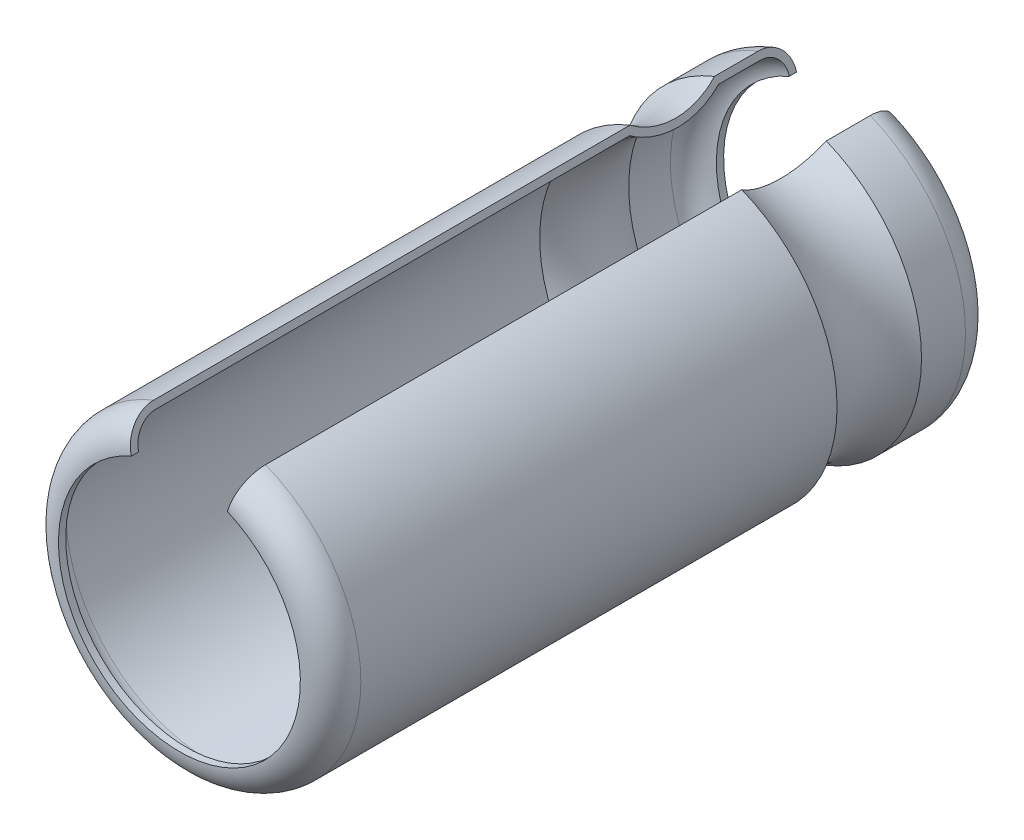
ISO-10303-21;
HEADER;
FILE_DESCRIPTION(('STEP AP214'),'2;1');
FILE_NAME('part.step','',(''),(''),'','','');
FILE_SCHEMA(('AUTOMOTIVE_DESIGN { 1 0 10303 214 1 1 1 1 }'));
ENDSEC;
DATA;
#1=APPLICATION_CONTEXT('core data for automotive mechanical design processes');
#2=APPLICATION_PROTOCOL_DEFINITION('international standard','automotive_design',2000,#1);
#3=PRODUCT_CONTEXT('',#1,'mechanical');
#4=PRODUCT('Part','Part','',(#3));
#5=PRODUCT_RELATED_PRODUCT_CATEGORY('part','',(#4));
#6=PRODUCT_DEFINITION_FORMATION('','',#4);
#7=PRODUCT_DEFINITION_CONTEXT('part definition',#1,'design');
#8=PRODUCT_DEFINITION('design','',#6,#7);
#9=PRODUCT_DEFINITION_SHAPE('','',#8);
#10=(LENGTH_UNIT() NAMED_UNIT(*) SI_UNIT(.MILLI.,.METRE.));
#11=(NAMED_UNIT(*) PLANE_ANGLE_UNIT() SI_UNIT($,.RADIAN.));
#12=(NAMED_UNIT(*) SI_UNIT($,.STERADIAN.) SOLID_ANGLE_UNIT());
#13=UNCERTAINTY_MEASURE_WITH_UNIT(LENGTH_MEASURE(1.E-05),#10,'distance_accuracy_value','');
#14=(GEOMETRIC_REPRESENTATION_CONTEXT(3) GLOBAL_UNCERTAINTY_ASSIGNED_CONTEXT((#13)) GLOBAL_UNIT_ASSIGNED_CONTEXT((#10,
#11,#12)) REPRESENTATION_CONTEXT('',''));
#15=CARTESIAN_POINT('',(0.,0.,0.));
#16=DIRECTION('',(0.,0.,1.));
#17=DIRECTION('',(1.,0.,0.));
#18=AXIS2_PLACEMENT_3D('',#15,#16,#17);
#19=CARTESIAN_POINT('',(-110.435261655171,-75.8999546142996,0.500000000000014));
#20=DIRECTION('',(0.,0.,-1.));
#21=DIRECTION('',(-1.,0.,0.));
#22=AXIS2_PLACEMENT_3D('',#19,#20,#21);
#23=TOROIDAL_SURFACE('',#22,2.00000000000004,0.380000000000008);
#24=CARTESIAN_POINT('',(-109.641007887324,-74.0644271826712,0.120000000000006));
#25=CARTESIAN_POINT('',(-109.635383906919,-74.0434382020589,0.119982183089945));
#26=CARTESIAN_POINT('',(-109.629760715521,-74.0224521660623,0.121823051311531));
#27=CARTESIAN_POINT('',(-109.618674853506,-73.9810791657739,0.12910120959926));
#28=CARTESIAN_POINT('',(-109.613212114462,-73.9606919461139,0.134536942657931));
#29=CARTESIAN_POINT('',(-109.60259748151,-73.9210775966342,0.14888877790404));
#30=CARTESIAN_POINT('',(-109.597445793778,-73.9018512362735,0.157807159898632));
#31=CARTESIAN_POINT('',(-109.587607669952,-73.8651348583048,0.178875538651264));
#32=CARTESIAN_POINT('',(-109.582921098948,-73.8476443372046,0.191024594546105));
#33=CARTESIAN_POINT('',(-109.57417577746,-73.8150063530818,0.218137979558773));
#34=CARTESIAN_POINT('',(-109.570113428074,-73.799845458777,0.233084976072417));
#35=CARTESIAN_POINT('',(-109.562701892984,-73.7721852332574,0.265426320594524));
#36=CARTESIAN_POINT('',(-109.55935284032,-73.7596863985578,0.282821124153812));
#37=CARTESIAN_POINT('',(-109.553494013475,-73.7378209590999,0.31940024723104));
#38=CARTESIAN_POINT('',(-109.550977386384,-73.7284287789311,0.338568202938987));
#39=CARTESIAN_POINT('',(-109.546820528276,-73.7129151732744,0.378267333702773));
#40=CARTESIAN_POINT('',(-109.545179682903,-73.7067914549753,0.398797541747954));
#41=CARTESIAN_POINT('',(-109.543256916143,-73.699615591733,0.43289149503634));
#42=CARTESIAN_POINT('',(-109.542696976279,-73.6975258677123,0.446230745932067));
#43=CARTESIAN_POINT('',(-109.541950048448,-73.6947382950981,0.473044696293518));
#44=CARTESIAN_POINT('',(-109.54176252331,-73.6940384417567,0.48651917245313));
#45=CARTESIAN_POINT('',(-109.541762899096,-73.6940398442099,0.499999999999719));
#46=B_SPLINE_CURVE_WITH_KNOTS('',3,(#24,#25,#26,#27,#28,#29,#30,#31,#32,#33,#34,#35,#36,#37,#38,
#39,#40,#41,#42,#43,#44,#45),.UNSPECIFIED.,.F.,.F.,(4,2,2,2,2,2,2,2,2,2,4),(0.,
0.0651062071288751,0.130184233915878,0.195304933604858,0.260406689043204,0.32511775482558,
0.389840879672177,0.454017082691879,0.518148207027383,0.558617254489897,0.599027886927853),.UNSPECIFIED.);
#47=CARTESIAN_POINT('',(-109.641007887324,-74.0644271826712,0.120000000000011));
#48=VERTEX_POINT('',#47);
#49=CARTESIAN_POINT('',(-109.541762899096,-73.6940398442106,0.499999999999867));
#50=VERTEX_POINT('',#49);
#51=EDGE_CURVE('E120',#48,#50,#46,.T.);
#52=ORIENTED_EDGE('',*,*,#51,.F.);
#53=CARTESIAN_POINT('',(-110.435261655171,-75.8999546142995,0.120000000000016));
#54=DIRECTION('',(0.,0.,1.));
#55=DIRECTION('',(1.,0.,0.));
#56=AXIS2_PLACEMENT_3D('',#53,#54,#55);
#57=CIRCLE('',#56,2.);
#58=CARTESIAN_POINT('',(-111.22951542302,-74.064427182672,0.120000000000013));
#59=VERTEX_POINT('',#58);
#60=EDGE_CURVE('E117',#48,#59,#57,.F.);
#61=ORIENTED_EDGE('',*,*,#60,.T.);
#62=CARTESIAN_POINT('',(-111.328760411247,-73.6940398442121,0.500000000000014));
#63=CARTESIAN_POINT('',(-111.328765258546,-73.6940217538469,0.478744711304542));
#64=CARTESIAN_POINT('',(-111.328295621978,-73.695774461382,0.457495662364422));
#65=CARTESIAN_POINT('',(-111.326443395238,-73.7026870656806,0.415620559484072));
#66=CARTESIAN_POINT('',(-111.325061698906,-73.7078436265919,0.394993916247575));
#67=CARTESIAN_POINT('',(-111.321420479222,-73.7214328434561,0.354921882304476));
#68=CARTESIAN_POINT('',(-111.319160590148,-73.7298668642973,0.335476987639925));
#69=CARTESIAN_POINT('',(-111.31383102529,-73.7497570711323,0.298325542391678));
#70=CARTESIAN_POINT('',(-111.31076144932,-73.7612128846083,0.280618777905263));
#71=CARTESIAN_POINT('',(-111.303890698521,-73.7868548756756,0.247382671889473));
#72=CARTESIAN_POINT('',(-111.300087374578,-73.801049073871,0.23185996419076));
#73=CARTESIAN_POINT('',(-111.291863805386,-73.831739851913,0.203477739930694));
#74=CARTESIAN_POINT('',(-111.287443438973,-73.8482368839536,0.190618747662325));
#75=CARTESIAN_POINT('',(-111.278077565105,-73.8831908010894,0.167828663163788));
#76=CARTESIAN_POINT('',(-111.27312839564,-73.9016613529884,0.157920063876288));
#77=CARTESIAN_POINT('',(-111.262873035486,-73.9399348781306,0.141426123151768));
#78=CARTESIAN_POINT('',(-111.257566998824,-73.95973727654,0.134839358289183));
#79=CARTESIAN_POINT('',(-111.248447507578,-73.9937716812095,0.126673396811358));
#80=CARTESIAN_POINT('',(-111.244687554064,-74.0078040187596,0.124171720097282));
#81=CARTESIAN_POINT('',(-111.237123997928,-74.0360315945451,0.120835164666015));
#82=CARTESIAN_POINT('',(-111.233320467161,-74.0502265646159,0.119997854352116));
#83=CARTESIAN_POINT('',(-111.22951542302,-74.064427182672,0.120000000000006));
#84=B_SPLINE_CURVE_WITH_KNOTS('',3,(#62,#63,#64,#65,#66,#67,#68,#69,#70,#71,#72,#73,#74,#75,#76,
#77,#78,#79,#80,#81,#82,#83),.UNSPECIFIED.,.F.,.F.,(4,2,2,2,2,2,2,2,2,2,4),(0.,
0.0636794548214654,0.127296594825147,0.190940256434635,0.254576075901636,0.318401191900391,
0.382238858538304,0.446551427783718,0.510836415249954,0.554970290773507,0.599039640304285),.UNSPECIFIED.);
#85=CARTESIAN_POINT('',(-111.328760411247,-73.6940398442121,0.500000000000014));
#86=VERTEX_POINT('',#85);
#87=EDGE_CURVE('E30',#86,#59,#84,.T.);
#88=ORIENTED_EDGE('',*,*,#87,.F.);
#89=CARTESIAN_POINT('',(-110.435261655171,-75.8999546142995,0.500000000000014));
#90=DIRECTION('',(0.,0.,1.));
#91=DIRECTION('',(1.,0.,0.));
#92=AXIS2_PLACEMENT_3D('',#89,#90,#91);
#93=CIRCLE('',#92,2.37999999999999);
#94=EDGE_CURVE('E136',#86,#50,#93,.T.);
#95=ORIENTED_EDGE('',*,*,#94,.T.);
#96=EDGE_LOOP('',(#52,#61,#88,#95));
#97=FACE_BOUND('',#96,.T.);
#98=ADVANCED_FACE('F25',(#97),#23,.F.);
#99=CARTESIAN_POINT('',(-110.435261655171,-75.8999546142995,0.86378142466053));
#100=DIRECTION('',(0.,0.,1.));
#101=DIRECTION('',(1.,0.,0.));
#102=AXIS2_PLACEMENT_3D('',#99,#100,#101);
#103=CYLINDRICAL_SURFACE('',#102,2.37999999999999);
#104=ORIENTED_EDGE('',*,*,#94,.F.);
#105=DIRECTION('',(0.,0.,1.));
#106=VECTOR('',#105,1.);
#107=CARTESIAN_POINT('',(-111.328760411247,-73.694039844212,0.86378142466053));
#108=LINE('',#107,#106);
#109=CARTESIAN_POINT('',(-111.328760411247,-73.694039844212,1.18968887625391));
#110=VERTEX_POINT('',#109);
#111=EDGE_CURVE('E111',#110,#86,#108,.F.);
#112=ORIENTED_EDGE('',*,*,#111,.F.);
#113=CARTESIAN_POINT('',(-110.435261655171,-75.8999546142995,1.1896888762539));
#114=DIRECTION('',(0.,0.,-1.));
#115=DIRECTION('',(-1.,0.,0.));
#116=AXIS2_PLACEMENT_3D('',#113,#114,#115);
#117=CIRCLE('',#116,2.38000000000001);
#118=CARTESIAN_POINT('',(-109.541762899097,-73.6940398442112,1.18968887625391));
#119=VERTEX_POINT('',#118);
#120=EDGE_CURVE('E219',#119,#110,#117,.T.);
#121=ORIENTED_EDGE('',*,*,#120,.F.);
#122=DIRECTION('',(0.,0.,1.));
#123=VECTOR('',#122,1.);
#124=CARTESIAN_POINT('',(-109.541762899096,-73.6940398442113,0.86378142466053));
#125=LINE('',#124,#123);
#126=EDGE_CURVE('E143',#50,#119,#125,.T.);
#127=ORIENTED_EDGE('',*,*,#126,.F.);
#128=EDGE_LOOP('',(#104,#112,#121,#127));
#129=FACE_BOUND('',#128,.T.);
#130=ADVANCED_FACE('F304',(#129),#103,.F.);
#131=CARTESIAN_POINT('',(-110.435261655171,-75.8999546142995,0.));
#132=DIRECTION('',(0.,0.,1.));
#133=DIRECTION('',(1.,0.,0.));
#134=AXIS2_PLACEMENT_3D('',#131,#132,#133);
#135=CYLINDRICAL_SURFACE('',#134,2.);
#136=CARTESIAN_POINT('',(-110.435261655171,-75.8999546142995,0.));
#137=DIRECTION('',(0.,0.,1.));
#138=DIRECTION('',(1.,0.,0.));
#139=AXIS2_PLACEMENT_3D('',#136,#137,#138);
#140=CIRCLE('',#139,1.99999999999988);
#141=CARTESIAN_POINT('',(-111.22951542302,-74.064427182672,0.));
#142=VERTEX_POINT('',#141);
#143=CARTESIAN_POINT('',(-109.641007887324,-74.0644271826712,0.));
#144=VERTEX_POINT('',#143);
#145=EDGE_CURVE('E135',#142,#144,#140,.T.);
#146=ORIENTED_EDGE('',*,*,#145,.F.);
#147=DIRECTION('',(0.,0.,1.));
#148=VECTOR('',#147,1.);
#149=CARTESIAN_POINT('',(-111.22951542302,-74.0644271826719,0.));
#150=LINE('',#149,#148);
#151=EDGE_CURVE('E131',#59,#142,#150,.F.);
#152=ORIENTED_EDGE('',*,*,#151,.F.);
#153=ORIENTED_EDGE('',*,*,#60,.F.);
#154=DIRECTION('',(0.,0.,1.));
#155=VECTOR('',#154,1.);
#156=CARTESIAN_POINT('',(-109.641007887323,-74.0644271826712,0.));
#157=LINE('',#156,#155);
#158=EDGE_CURVE('E125',#144,#48,#157,.T.);
#159=ORIENTED_EDGE('',*,*,#158,.F.);
#160=EDGE_LOOP('',(#146,#152,#153,#159));
#161=FACE_BOUND('',#160,.T.);
#162=ADVANCED_FACE('F133',(#161),#135,.F.);
#163=CARTESIAN_POINT('',(-110.435261655171,-75.8999546142995,1.92584497229592));
#164=DIRECTION('',(0.,0.,-1.));
#165=DIRECTION('',(-1.,0.,0.));
#166=AXIS2_PLACEMENT_3D('',#163,#164,#165);
#167=TOROIDAL_SURFACE('',#166,3.46382852414183,1.3101946677816);
#168=CARTESIAN_POINT('',(-111.328760411247,-73.6940398442121,1.18968887625389));
#169=CARTESIAN_POINT('',(-111.323396560608,-73.714058007324,1.21997083257175));
#170=CARTESIAN_POINT('',(-111.318363919213,-73.7328400807056,1.25110792210303));
#171=CARTESIAN_POINT('',(-111.308992004249,-73.7678165435154,1.31490234502008));
#172=CARTESIAN_POINT('',(-111.304652727418,-73.7840109451165,1.34755967125348));
#173=CARTESIAN_POINT('',(-111.292732329592,-73.8284984754499,1.44743497021773));
#174=CARTESIAN_POINT('',(-111.286233591997,-73.8527520943403,1.51664133044735));
#175=CARTESIAN_POINT('',(-111.276342157542,-73.8896674302832,1.65830137878725));
#176=CARTESIAN_POINT('',(-111.272951346183,-73.9023221105569,1.73075701022864));
#177=CARTESIAN_POINT('',(-111.269382278693,-73.9156420517624,1.87683879603604));
#178=CARTESIAN_POINT('',(-111.269203414399,-73.9163095823983,1.95046472616963));
#179=CARTESIAN_POINT('',(-111.272056625018,-73.9056612554009,2.09646857368301));
#180=CARTESIAN_POINT('',(-111.275075665037,-73.8943940446614,2.16885034466408));
#181=CARTESIAN_POINT('',(-111.284213777839,-73.8602901433998,2.31062461659469));
#182=CARTESIAN_POINT('',(-111.290331291315,-73.8374592722906,2.38001860210696));
#183=CARTESIAN_POINT('',(-111.302157128094,-73.7933246485888,2.48456492158868));
#184=CARTESIAN_POINT('',(-111.306876878447,-73.7757103004732,2.52143339000838));
#185=CARTESIAN_POINT('',(-111.317180999474,-73.7372547972738,2.59322339647109));
#186=CARTESIAN_POINT('',(-111.322763612199,-73.7164202029428,2.62814870091386));
#187=CARTESIAN_POINT('',(-111.328760411248,-73.6940398442121,2.66200106833794));
#188=B_SPLINE_CURVE_WITH_KNOTS('',3,(#168,#169,#170,#171,#172,#173,#174,#175,#176,#177,#178,
#179,#180,#181,#182,#183,#184,#185,#186,#187),.UNSPECIFIED.,.F.,.F.,(4,2,2,2,2,2,2,2,2,4),(0.,
0.110017338386147,0.220034159216963,0.439762589306003,0.659624234937885,0.87944425047677,
1.09837169873832,1.31718908105632,1.44042167105631,1.5634064250173),.UNSPECIFIED.);
#189=CARTESIAN_POINT('',(-111.328760411248,-73.6940398442121,2.66200106833794));
#190=VERTEX_POINT('',#189);
#191=EDGE_CURVE('E211',#110,#190,#188,.T.);
#192=ORIENTED_EDGE('',*,*,#191,.T.);
#193=CARTESIAN_POINT('',(-110.435261655171,-75.8999546142995,2.66200106833791));
#194=DIRECTION('',(0.,0.,1.));
#195=DIRECTION('',(1.,0.,0.));
#196=AXIS2_PLACEMENT_3D('',#193,#194,#195);
#197=CIRCLE('',#196,2.38000000000001);
#198=CARTESIAN_POINT('',(-109.541762899097,-73.6940398442112,2.66200106833791));
#199=VERTEX_POINT('',#198);
#200=EDGE_CURVE('E281',#190,#199,#197,.T.);
#201=ORIENTED_EDGE('',*,*,#200,.T.);
#202=CARTESIAN_POINT('',(-109.541762899097,-73.6940398442112,2.66200106833791));
#203=CARTESIAN_POINT('',(-109.547126749737,-73.7140580073231,2.63171911202004));
#204=CARTESIAN_POINT('',(-109.552159391131,-73.7328400807047,2.60058202248876));
#205=CARTESIAN_POINT('',(-109.561531306095,-73.7678165435145,2.5367875995717));
#206=CARTESIAN_POINT('',(-109.565870582926,-73.7840109451156,2.5041302733383));
#207=CARTESIAN_POINT('',(-109.577790980752,-73.828498475449,2.40425497437403));
#208=CARTESIAN_POINT('',(-109.584289718348,-73.8527520943394,2.3350486141444));
#209=CARTESIAN_POINT('',(-109.594181152802,-73.8896674302822,2.19338856580449));
#210=CARTESIAN_POINT('',(-109.597571964162,-73.902322110556,2.1209329343631));
#211=CARTESIAN_POINT('',(-109.601141031651,-73.9156420517615,1.97485114855568));
#212=CARTESIAN_POINT('',(-109.601319895946,-73.9163095823974,1.90122521842209));
#213=CARTESIAN_POINT('',(-109.598466685326,-73.9056612553999,1.7552213709087));
#214=CARTESIAN_POINT('',(-109.595447645307,-73.8943940446604,1.68283959992762));
#215=CARTESIAN_POINT('',(-109.586309532506,-73.8602901433988,1.54106532799698));
#216=CARTESIAN_POINT('',(-109.580192019029,-73.8374592722896,1.47167134248471));
#217=CARTESIAN_POINT('',(-109.56836618225,-73.7933246485878,1.36712502300302));
#218=CARTESIAN_POINT('',(-109.563646431897,-73.7757103004722,1.33025655458336));
#219=CARTESIAN_POINT('',(-109.553342310871,-73.7372547972728,1.25846654812072));
#220=CARTESIAN_POINT('',(-109.547759698145,-73.7164202029418,1.22354124367798));
#221=CARTESIAN_POINT('',(-109.541762899097,-73.6940398442112,1.18968887625393));
#222=B_SPLINE_CURVE_WITH_KNOTS('',3,(#202,#203,#204,#205,#206,#207,#208,#209,#210,#211,#212,
#213,#214,#215,#216,#217,#218,#219,#220,#221),.UNSPECIFIED.,.F.,.F.,(4,2,2,2,2,2,2,2,2,4),(0.,
0.110017338386162,0.22003415921699,0.439762589306041,0.659624234937941,0.879444250476841,
1.09837169873842,1.31718908105645,1.44042167105631,1.56340642501719),.UNSPECIFIED.);
#223=EDGE_CURVE('E124',#199,#119,#222,.T.);
#224=ORIENTED_EDGE('',*,*,#223,.T.);
#225=ORIENTED_EDGE('',*,*,#120,.T.);
#226=EDGE_LOOP('',(#192,#201,#224,#225));
#227=FACE_BOUND('',#226,.T.);
#228=ADVANCED_FACE('F226',(#227),#167,.T.);
#229=CARTESIAN_POINT('',(-110.435261655171,-75.8999546142995,0.500000000000006));
#230=DIRECTION('',(0.,0.,-1.));
#231=DIRECTION('',(-1.,0.,0.));
#232=AXIS2_PLACEMENT_3D('',#229,#230,#231);
#233=TOROIDAL_SURFACE('',#232,2.00000000000002,0.5);
#234=CARTESIAN_POINT('',(-111.360043841352,-73.5772884936265,0.500000000000014));
#235=CARTESIAN_POINT('',(-111.360050192614,-73.5772647903935,0.472019155341316));
#236=CARTESIAN_POINT('',(-111.359432127665,-73.5795714401858,0.444046375610832));
#237=CARTESIAN_POINT('',(-111.356994309867,-73.588669500069,0.388920031090644));
#238=CARTESIAN_POINT('',(-111.355175705492,-73.5954566239945,0.36176570927226));
#239=CARTESIAN_POINT('',(-111.350382769908,-73.6133441031125,0.309011728281393));
#240=CARTESIAN_POINT('',(-111.34740794753,-73.6244462913688,0.283412735172575));
#241=CARTESIAN_POINT('',(-111.340391835305,-73.650630778666,0.234504162450101));
#242=CARTESIAN_POINT('',(-111.336350683677,-73.665712561863,0.211194286653029));
#243=CARTESIAN_POINT('',(-111.327306258642,-73.6994668156163,0.167451463940958));
#244=CARTESIAN_POINT('',(-111.322300501491,-73.7181485556343,0.147026185031998));
#245=CARTESIAN_POINT('',(-111.311476710754,-73.758543492597,0.109683470596935));
#246=CARTESIAN_POINT('',(-111.305658521391,-73.7802572709087,0.0927667093482462));
#247=CARTESIAN_POINT('',(-111.293334970555,-73.826249388758,0.0628010968384474));
#248=CARTESIAN_POINT('',(-111.286825231323,-73.8505440663159,0.0497791546176314));
#249=CARTESIAN_POINT('',(-111.273336489155,-73.9008847374177,0.0281077792788703));
#250=CARTESIAN_POINT('',(-111.266357688316,-73.9269299767233,0.0194564765594968));
#251=CARTESIAN_POINT('',(-111.254371752737,-73.9716620972789,0.00874404719554668));
#252=CARTESIAN_POINT('',(-111.249435049634,-73.9900861240842,0.00546589611604559));
#253=CARTESIAN_POINT('',(-111.239504631594,-74.0271469487469,0.00109406189961394));
#254=CARTESIAN_POINT('',(-111.234511011337,-74.0457833932597,-2.83150096023068E-06));
#255=CARTESIAN_POINT('',(-111.22951542302,-74.064427182672,0.));
#256=B_SPLINE_CURVE_WITH_KNOTS('',3,(#234,#235,#236,#237,#238,#239,#240,#241,#242,#243,#244,
#245,#246,#247,#248,#249,#250,#251,#252,#253,#254,#255),.UNSPECIFIED.,.F.,.F.,(4,2,2,2,2,2,2,2,
2,2,4),(0.,0.0838290787197718,0.167578079838992,0.251362696964813,0.335136459076647,
0.419128882789231,0.5031374334898,0.587713654639952,0.672253666444674,0.730197257097966,
0.78805550603238),.UNSPECIFIED.);
#257=CARTESIAN_POINT('',(-111.360043841352,-73.5772884936265,0.500000000000014));
#258=VERTEX_POINT('',#257);
#259=EDGE_CURVE('E185',#258,#142,#256,.T.);
#260=ORIENTED_EDGE('',*,*,#259,.T.);
#261=ORIENTED_EDGE('',*,*,#145,.T.);
#262=CARTESIAN_POINT('',(-109.641007887324,-74.0644271826712,0.));
#263=CARTESIAN_POINT('',(-109.633612648931,-74.0368277772533,-2.36770548306193E-05));
#264=CARTESIAN_POINT('',(-109.626218359629,-74.0092319138945,0.00239568116527948));
#265=CARTESIAN_POINT('',(-109.611640749587,-73.9548275325627,0.0119630832168439));
#266=CARTESIAN_POINT('',(-109.604457339795,-73.92801868225,0.019109100182246));
#267=CARTESIAN_POINT('',(-109.590499174136,-73.8759260988307,0.0379790271321366));
#268=CARTESIAN_POINT('',(-109.583724696458,-73.8506434039382,0.0497060138303902));
#269=CARTESIAN_POINT('',(-109.570787738363,-73.8023620190324,0.0774105279081761));
#270=CARTESIAN_POINT('',(-109.564625077484,-73.7793626555224,0.0933867967639462));
#271=CARTESIAN_POINT('',(-109.553126664791,-73.7364499951485,0.129037565640599));
#272=CARTESIAN_POINT('',(-109.547786009681,-73.7165183989325,0.148688453159846));
#273=CARTESIAN_POINT('',(-109.538041803334,-73.680152525764,0.191206242485931));
#274=CARTESIAN_POINT('',(-109.533638430158,-73.6637189133472,0.214073754008561));
#275=CARTESIAN_POINT('',(-109.525932283704,-73.6349591832492,0.262170993426052));
#276=CARTESIAN_POINT('',(-109.522621000079,-73.6226013045248,0.28738039353119));
#277=CARTESIAN_POINT('',(-109.51715019038,-73.6021839647663,0.339592051391583));
#278=CARTESIAN_POINT('',(-109.514989866957,-73.5941215279908,0.366593053363192));
#279=CARTESIAN_POINT('',(-109.512453591923,-73.5846560207045,0.411482813237986));
#280=CARTESIAN_POINT('',(-109.511713711661,-73.5818947499729,0.42907708227921));
#281=CARTESIAN_POINT('',(-109.510726756041,-73.5782113814542,0.464444984379377));
#282=CARTESIAN_POINT('',(-109.510478970256,-73.5772866323175,0.482218321581617));
#283=CARTESIAN_POINT('',(-109.510479468992,-73.5772884936256,0.500000000000016));
#284=B_SPLINE_CURVE_WITH_KNOTS('',3,(#262,#263,#264,#265,#266,#267,#268,#269,#270,#271,#272,
#273,#274,#275,#276,#277,#278,#279,#280,#281,#282,#283),.UNSPECIFIED.,.F.,.F.,(4,2,2,2,2,2,2,2,
2,2,4),(0.,0.0856118104562887,0.171186932993569,0.256819629387871,0.342426991854373,
0.427502065284804,0.512593286605446,0.597004821965595,0.681357803489695,0.734737927872076,
0.788040932253145),.UNSPECIFIED.);
#285=CARTESIAN_POINT('',(-109.510479468992,-73.5772884936257,0.500000000000013));
#286=VERTEX_POINT('',#285);
#287=EDGE_CURVE('E218',#144,#286,#284,.T.);
#288=ORIENTED_EDGE('',*,*,#287,.T.);
#289=CARTESIAN_POINT('',(-110.435261655171,-75.8999546142995,0.500000000000014));
#290=DIRECTION('',(0.,0.,1.));
#291=DIRECTION('',(1.,0.,0.));
#292=AXIS2_PLACEMENT_3D('',#289,#290,#291);
#293=CIRCLE('',#292,2.5);
#294=EDGE_CURVE('E288',#258,#286,#293,.T.);
#295=ORIENTED_EDGE('',*,*,#294,.F.);
#296=EDGE_LOOP('',(#260,#261,#288,#295));
#297=FACE_BOUND('',#296,.T.);
#298=ADVANCED_FACE('F229',(#297),#233,.T.);
#299=CARTESIAN_POINT('',(-110.435261655171,-75.8999546142995,6.56206354763538));
#300=DIRECTION('',(0.,0.,1.));
#301=DIRECTION('',(1.,0.,0.));
#302=AXIS2_PLACEMENT_3D('',#299,#300,#301);
#303=CYLINDRICAL_SURFACE('',#302,2.38000000000001);
#304=ORIENTED_EDGE('',*,*,#200,.F.);
#305=DIRECTION('',(0.,0.,1.));
#306=VECTOR('',#305,1.);
#307=CARTESIAN_POINT('',(-111.328760411248,-73.6940398442121,5.49999999999999));
#308=LINE('',#307,#306);
#309=CARTESIAN_POINT('',(-111.328760411248,-73.6940398442121,10.5));
#310=VERTEX_POINT('',#309);
#311=EDGE_CURVE('E274',#190,#310,#308,.T.);
#312=ORIENTED_EDGE('',*,*,#311,.T.);
#313=CARTESIAN_POINT('',(-110.435261655171,-75.8999546142995,10.5));
#314=DIRECTION('',(0.,0.,1.));
#315=DIRECTION('',(1.,0.,0.));
#316=AXIS2_PLACEMENT_3D('',#313,#314,#315);
#317=CIRCLE('',#316,2.38);
#318=CARTESIAN_POINT('',(-109.541762899097,-73.6940398442106,10.5000000000001));
#319=VERTEX_POINT('',#318);
#320=EDGE_CURVE('E278',#310,#319,#317,.T.);
#321=ORIENTED_EDGE('',*,*,#320,.T.);
#322=DIRECTION('',(0.,0.,1.));
#323=VECTOR('',#322,1.);
#324=CARTESIAN_POINT('',(-109.541762899097,-73.6940398442112,5.5));
#325=LINE('',#324,#323);
#326=EDGE_CURVE('E301',#319,#199,#325,.F.);
#327=ORIENTED_EDGE('',*,*,#326,.T.);
#328=EDGE_LOOP('',(#304,#312,#321,#327));
#329=FACE_BOUND('',#328,.T.);
#330=ADVANCED_FACE('F199',(#329),#303,.F.);
#331=CARTESIAN_POINT('',(-110.435261655171,-75.8999546142995,10.5));
#332=DIRECTION('',(0.,0.,-1.));
#333=DIRECTION('',(-1.,0.,0.));
#334=AXIS2_PLACEMENT_3D('',#331,#332,#333);
#335=TOROIDAL_SURFACE('',#334,1.99999999999994,0.38000000000001);
#336=ORIENTED_EDGE('',*,*,#320,.F.);
#337=CARTESIAN_POINT('',(-111.328760411248,-73.6940398442121,10.5));
#338=CARTESIAN_POINT('',(-111.328765258546,-73.694021753847,10.5212552886955));
#339=CARTESIAN_POINT('',(-111.328295621978,-73.695774461382,10.5425043376356));
#340=CARTESIAN_POINT('',(-111.326443395238,-73.7026870656807,10.5843794405159));
#341=CARTESIAN_POINT('',(-111.325061698906,-73.7078436265919,10.6050060837524));
#342=CARTESIAN_POINT('',(-111.321420479222,-73.7214328434561,10.6450781176955));
#343=CARTESIAN_POINT('',(-111.319160590149,-73.7298668642973,10.6645230123601));
#344=CARTESIAN_POINT('',(-111.31383102529,-73.7497570711323,10.7016744576083));
#345=CARTESIAN_POINT('',(-111.31076144932,-73.7612128846083,10.7193812220947));
#346=CARTESIAN_POINT('',(-111.303890698521,-73.7868548756756,10.7526173281105));
#347=CARTESIAN_POINT('',(-111.300087374578,-73.801049073871,10.7681400358093));
#348=CARTESIAN_POINT('',(-111.291863805386,-73.831739851913,10.7965222600693));
#349=CARTESIAN_POINT('',(-111.287443438974,-73.8482368839536,10.8093812523377));
#350=CARTESIAN_POINT('',(-111.278077565105,-73.8831908010895,10.8321713368362));
#351=CARTESIAN_POINT('',(-111.27312839564,-73.9016613529884,10.8420799361237));
#352=CARTESIAN_POINT('',(-111.262873035486,-73.9399348781306,10.8585738768482));
#353=CARTESIAN_POINT('',(-111.257566998824,-73.95973727654,10.8651606417108));
#354=CARTESIAN_POINT('',(-111.248447507578,-73.9937716812095,10.8733266031887));
#355=CARTESIAN_POINT('',(-111.244687554064,-74.0078040187596,10.8758282799027));
#356=CARTESIAN_POINT('',(-111.237123997928,-74.0360315945451,10.879164835334));
#357=CARTESIAN_POINT('',(-111.233320467161,-74.0502265646159,10.8800021456479));
#358=CARTESIAN_POINT('',(-111.22951542302,-74.064427182672,10.88));
#359=B_SPLINE_CURVE_WITH_KNOTS('',3,(#337,#338,#339,#340,#341,#342,#343,#344,#345,#346,#347,
#348,#349,#350,#351,#352,#353,#354,#355,#356,#357,#358),.UNSPECIFIED.,.F.,.F.,(4,2,2,2,2,2,2,2,
2,2,4),(0.,0.0636794548214659,0.127296594825144,0.190940256434633,0.254576075901642,
0.318401191900398,0.382238858538297,0.446551427783697,0.510836415249934,0.554970290773487,
0.599039640304279),.UNSPECIFIED.);
#360=CARTESIAN_POINT('',(-111.22951542302,-74.064427182672,10.88));
#361=VERTEX_POINT('',#360);
#362=EDGE_CURVE('E205',#310,#361,#359,.T.);
#363=ORIENTED_EDGE('',*,*,#362,.T.);
#364=CARTESIAN_POINT('',(-110.435261655171,-75.8999546142995,10.88));
#365=DIRECTION('',(0.,0.,1.));
#366=DIRECTION('',(1.,0.,0.));
#367=AXIS2_PLACEMENT_3D('',#364,#365,#366);
#368=CIRCLE('',#367,2.00000000000002);
#369=CARTESIAN_POINT('',(-109.641007887324,-74.0644271826712,10.88));
#370=VERTEX_POINT('',#369);
#371=EDGE_CURVE('E259',#361,#370,#368,.T.);
#372=ORIENTED_EDGE('',*,*,#371,.T.);
#373=CARTESIAN_POINT('',(-109.641007887324,-74.0644271826711,10.88));
#374=CARTESIAN_POINT('',(-109.635383906919,-74.0434382020589,10.8800178169101));
#375=CARTESIAN_POINT('',(-109.629760715521,-74.0224521660623,10.8781769486885));
#376=CARTESIAN_POINT('',(-109.618674853505,-73.9810791657739,10.8708987904007));
#377=CARTESIAN_POINT('',(-109.613212114462,-73.9606919461138,10.8654630573421));
#378=CARTESIAN_POINT('',(-109.60259748151,-73.9210775966342,10.851111222096));
#379=CARTESIAN_POINT('',(-109.597445793778,-73.9018512362735,10.8421928401014));
#380=CARTESIAN_POINT('',(-109.587607669952,-73.8651348583047,10.8211244613487));
#381=CARTESIAN_POINT('',(-109.582921098948,-73.8476443372046,10.8089754054539));
#382=CARTESIAN_POINT('',(-109.57417577746,-73.8150063530818,10.7818620204412));
#383=CARTESIAN_POINT('',(-109.570113428074,-73.799845458777,10.7669150239276));
#384=CARTESIAN_POINT('',(-109.562701892984,-73.7721852332574,10.7345736794055));
#385=CARTESIAN_POINT('',(-109.55935284032,-73.7596863985578,10.7171788758462));
#386=CARTESIAN_POINT('',(-109.553494013475,-73.7378209590999,10.6805997527689));
#387=CARTESIAN_POINT('',(-109.550977386384,-73.7284287789311,10.661431797061));
#388=CARTESIAN_POINT('',(-109.546820528276,-73.7129151732744,10.6217326662972));
#389=CARTESIAN_POINT('',(-109.545179682903,-73.7067914549753,10.601202458252));
#390=CARTESIAN_POINT('',(-109.543256916142,-73.6996155917331,10.5671085049636));
#391=CARTESIAN_POINT('',(-109.542696976279,-73.6975258677124,10.5537692540679));
#392=CARTESIAN_POINT('',(-109.541950048448,-73.6947382950981,10.5269553037065));
#393=CARTESIAN_POINT('',(-109.54176252331,-73.6940384417567,10.5134808275469));
#394=CARTESIAN_POINT('',(-109.541762899096,-73.6940398442099,10.5000000000003));
#395=B_SPLINE_CURVE_WITH_KNOTS('',3,(#373,#374,#375,#376,#377,#378,#379,#380,#381,#382,#383,
#384,#385,#386,#387,#388,#389,#390,#391,#392,#393,#394),.UNSPECIFIED.,.F.,.F.,(4,2,2,2,2,2,2,2,
2,2,4),(0.,0.0651062071288624,0.130184233915867,0.19530493360485,0.260406689043184,
0.325117754825562,0.389840879672162,0.454017082691863,0.518148207027367,0.558617254489867,
0.599027886927804),.UNSPECIFIED.);
#396=EDGE_CURVE('E159',#370,#319,#395,.T.);
#397=ORIENTED_EDGE('',*,*,#396,.T.);
#398=EDGE_LOOP('',(#336,#363,#372,#397));
#399=FACE_BOUND('',#398,.T.);
#400=ADVANCED_FACE('F174',(#399),#335,.F.);
#401=CARTESIAN_POINT('',(-110.773424138465,-75.7665830295222,5.49999999999999));
#402=DIRECTION('',(-0.965925826289067,-0.258819045102527,0.));
#403=DIRECTION('',(0.258819045102527,-0.965925826289067,0.));
#404=AXIS2_PLACEMENT_3D('',#401,#402,#403);
#405=PLANE('',#404);
#406=ORIENTED_EDGE('',*,*,#311,.F.);
#407=ORIENTED_EDGE('',*,*,#191,.F.);
#408=ORIENTED_EDGE('',*,*,#111,.T.);
#409=ORIENTED_EDGE('',*,*,#87,.T.);
#410=ORIENTED_EDGE('',*,*,#151,.T.);
#411=ORIENTED_EDGE('',*,*,#259,.F.);
#412=DIRECTION('',(0.,0.,1.));
#413=VECTOR('',#412,1.);
#414=CARTESIAN_POINT('',(-111.360043841352,-73.5772884936265,0.86378142466053));
#415=LINE('',#414,#413);
#416=CARTESIAN_POINT('',(-111.360043841352,-73.5772884936265,1.22756284932099));
#417=VERTEX_POINT('',#416);
#418=EDGE_CURVE('E290',#417,#258,#415,.F.);
#419=ORIENTED_EDGE('',*,*,#418,.F.);
#420=CARTESIAN_POINT('',(-111.360043841352,-73.5772884936265,2.62412709527084));
#421=CARTESIAN_POINT('',(-111.35495531706,-73.5962791248192,2.59717530276469));
#422=CARTESIAN_POINT('',(-111.350161898238,-73.6141684074075,2.56941101874186));
#423=CARTESIAN_POINT('',(-111.34119462022,-73.6476347445746,2.51242748064869));
#424=CARTESIAN_POINT('',(-111.337020755394,-73.663211820169,2.48320823980572));
#425=CARTESIAN_POINT('',(-111.325482020235,-73.7062749660369,2.39369709755736));
#426=CARTESIAN_POINT('',(-111.319087125413,-73.7301410384236,2.33148344865056));
#427=CARTESIAN_POINT('',(-111.309096940756,-73.7674249151402,2.20377876176867));
#428=CARTESIAN_POINT('',(-111.305503314093,-73.7808365124291,2.13828580131516));
#429=CARTESIAN_POINT('',(-111.301226922714,-73.7967962223274,2.00590776950695));
#430=CARTESIAN_POINT('',(-111.300543178365,-73.7993479909802,1.939023174278));
#431=CARTESIAN_POINT('',(-111.302102708819,-73.7935277440901,1.80603875650422));
#432=CARTESIAN_POINT('',(-111.304334407536,-73.7851989310879,1.73993687548274));
#433=CARTESIAN_POINT('',(-111.311638498347,-73.7579396930782,1.61010516740008));
#434=CARTESIAN_POINT('',(-111.316710749656,-73.7390097934849,1.54637522294722));
#435=CARTESIAN_POINT('',(-111.327872237818,-73.6973545525761,1.43912101729097));
#436=CARTESIAN_POINT('',(-111.333357104698,-73.6768847507097,1.39464108097275));
#437=CARTESIAN_POINT('',(-111.345696602594,-73.6308331176194,1.3087020771001));
#438=CARTESIAN_POINT('',(-111.352549156078,-73.6052590398581,1.26723855635695));
#439=CARTESIAN_POINT('',(-111.360043841352,-73.5772884936265,1.22756284932101));
#440=B_SPLINE_CURVE_WITH_KNOTS('',3,(#420,#421,#422,#423,#424,#425,#426,#427,#428,#429,#430,
#431,#432,#433,#434,#435,#436,#437,#438,#439),.UNSPECIFIED.,.F.,.F.,(4,2,2,2,2,2,2,2,2,4),(0.,
0.100021539703985,0.200042170254068,0.39983302757175,0.599742414755174,0.799584495608532,
0.99863548827028,1.19767661637984,1.34512683306863,1.49235475260809),.UNSPECIFIED.);
#441=CARTESIAN_POINT('',(-111.360043841352,-73.5772884936265,2.62412709527084));
#442=VERTEX_POINT('',#441);
#443=EDGE_CURVE('E179',#442,#417,#440,.T.);
#444=ORIENTED_EDGE('',*,*,#443,.F.);
#445=DIRECTION('',(0.,0.,1.));
#446=VECTOR('',#445,1.);
#447=CARTESIAN_POINT('',(-111.360043841352,-73.5772884936265,6.56206354763538));
#448=LINE('',#447,#446);
#449=CARTESIAN_POINT('',(-111.360043841352,-73.5772884936265,10.5));
#450=VERTEX_POINT('',#449);
#451=EDGE_CURVE('E267',#450,#442,#448,.F.);
#452=ORIENTED_EDGE('',*,*,#451,.F.);
#453=CARTESIAN_POINT('',(-111.22951542302,-74.0644271826721,11.));
#454=CARTESIAN_POINT('',(-111.236910661414,-74.0368277772542,11.0000236770548));
#455=CARTESIAN_POINT('',(-111.244304950715,-74.0092319138954,10.9976043188347));
#456=CARTESIAN_POINT('',(-111.258882560758,-73.9548275325636,10.9880369167831));
#457=CARTESIAN_POINT('',(-111.266065970549,-73.9280186822509,10.9808908998177));
#458=CARTESIAN_POINT('',(-111.280024136208,-73.8759260988315,10.9620209728678));
#459=CARTESIAN_POINT('',(-111.286798613887,-73.8506434039391,10.9502939861696));
#460=CARTESIAN_POINT('',(-111.299735571982,-73.8023620190332,10.9225894720918));
#461=CARTESIAN_POINT('',(-111.305898232861,-73.7793626555232,10.906613203236));
#462=CARTESIAN_POINT('',(-111.317396645553,-73.7364499951493,10.8709624343593));
#463=CARTESIAN_POINT('',(-111.322737300663,-73.7165183989333,10.8513115468401));
#464=CARTESIAN_POINT('',(-111.332481507011,-73.6801525257648,10.808793757514));
#465=CARTESIAN_POINT('',(-111.336884880186,-73.663718913348,10.7859262459913));
#466=CARTESIAN_POINT('',(-111.344591026641,-73.63495918325,10.7378290065738));
#467=CARTESIAN_POINT('',(-111.347902310265,-73.6226013045256,10.7126196064687));
#468=CARTESIAN_POINT('',(-111.353373119965,-73.6021839647672,10.6604079486083));
#469=CARTESIAN_POINT('',(-111.355533443388,-73.5941215279917,10.6334069466367));
#470=CARTESIAN_POINT('',(-111.358069718421,-73.5846560207054,10.5885171867619));
#471=CARTESIAN_POINT('',(-111.358809598684,-73.5818947499738,10.5709229177207));
#472=CARTESIAN_POINT('',(-111.359796554304,-73.5782113814551,10.5355550156206));
#473=CARTESIAN_POINT('',(-111.360044340088,-73.5772866323184,10.5177816784184));
#474=CARTESIAN_POINT('',(-111.360043841352,-73.5772884936265,10.5));
#475=B_SPLINE_CURVE_WITH_KNOTS('',3,(#453,#454,#455,#456,#457,#458,#459,#460,#461,#462,#463,
#464,#465,#466,#467,#468,#469,#470,#471,#472,#473,#474),.UNSPECIFIED.,.F.,.F.,(4,2,2,2,2,2,2,2,
2,2,4),(0.,0.0856118104563027,0.17118693299363,0.256819629387969,0.342426991854484,
0.427502065284931,0.512593286605587,0.597004821965737,0.681357803489849,0.734737927872146,
0.788040932253138),.UNSPECIFIED.);
#476=CARTESIAN_POINT('',(-111.22951542302,-74.0644271826721,11.));
#477=VERTEX_POINT('',#476);
#478=EDGE_CURVE('E186',#477,#450,#475,.T.);
#479=ORIENTED_EDGE('',*,*,#478,.F.);
#480=DIRECTION('',(0.,0.,1.));
#481=VECTOR('',#480,1.);
#482=CARTESIAN_POINT('',(-111.22951542302,-74.064427182672,11.2676512803316));
#483=LINE('',#482,#481);
#484=EDGE_CURVE('E261',#477,#361,#483,.F.);
#485=ORIENTED_EDGE('',*,*,#484,.T.);
#486=ORIENTED_EDGE('',*,*,#362,.F.);
#487=EDGE_LOOP('',(#406,#407,#408,#409,#410,#411,#419,#444,#452,#479,#485,#486));
#488=FACE_BOUND('',#487,.T.);
#489=ADVANCED_FACE('F129',(#488),#405,.F.);
#490=CARTESIAN_POINT('',(-110.435261655171,-75.8999546142995,0.86378142466053));
#491=DIRECTION('',(0.,0.,1.));
#492=DIRECTION('',(1.,0.,0.));
#493=AXIS2_PLACEMENT_3D('',#490,#491,#492);
#494=CYLINDRICAL_SURFACE('',#493,2.5);
#495=CARTESIAN_POINT('',(-110.435261655171,-75.8999546142995,1.22756284932097));
#496=DIRECTION('',(0.,0.,-1.));
#497=DIRECTION('',(-1.,0.,0.));
#498=AXIS2_PLACEMENT_3D('',#495,#496,#497);
#499=CIRCLE('',#498,2.50000000000008);
#500=CARTESIAN_POINT('',(-109.510479468992,-73.5772884936257,1.22756284932109));
#501=VERTEX_POINT('',#500);
#502=EDGE_CURVE('E158',#501,#417,#499,.T.);
#503=ORIENTED_EDGE('',*,*,#502,.T.);
#504=ORIENTED_EDGE('',*,*,#418,.T.);
#505=ORIENTED_EDGE('',*,*,#294,.T.);
#506=DIRECTION('',(0.,0.,1.));
#507=VECTOR('',#506,1.);
#508=CARTESIAN_POINT('',(-109.510479468992,-73.5772884936257,5.5));
#509=LINE('',#508,#507);
#510=EDGE_CURVE('E315',#286,#501,#509,.T.);
#511=ORIENTED_EDGE('',*,*,#510,.T.);
#512=EDGE_LOOP('',(#503,#504,#505,#511));
#513=FACE_BOUND('',#512,.T.);
#514=ADVANCED_FACE('F198',(#513),#494,.T.);
#515=CARTESIAN_POINT('',(-110.153094659151,-75.975561033014,5.5));
#516=DIRECTION('',(0.965925826289072,-0.258819045102508,0.));
#517=DIRECTION('',(0.258819045102508,0.965925826289072,0.));
#518=AXIS2_PLACEMENT_3D('',#515,#516,#517);
#519=PLANE('',#518);
#520=ORIENTED_EDGE('',*,*,#51,.T.);
#521=ORIENTED_EDGE('',*,*,#126,.T.);
#522=ORIENTED_EDGE('',*,*,#223,.F.);
#523=ORIENTED_EDGE('',*,*,#326,.F.);
#524=ORIENTED_EDGE('',*,*,#396,.F.);
#525=DIRECTION('',(0.,0.,1.));
#526=VECTOR('',#525,1.);
#527=CARTESIAN_POINT('',(-109.641007887323,-74.0644271826712,11.2676512803316));
#528=LINE('',#527,#526);
#529=CARTESIAN_POINT('',(-109.641007887324,-74.0644271826712,11.));
#530=VERTEX_POINT('',#529);
#531=EDGE_CURVE('E263',#370,#530,#528,.T.);
#532=ORIENTED_EDGE('',*,*,#531,.T.);
#533=CARTESIAN_POINT('',(-109.510479468992,-73.5772884936256,10.5));
#534=CARTESIAN_POINT('',(-109.51047311773,-73.5772647903926,10.5279808446587));
#535=CARTESIAN_POINT('',(-109.511091182679,-73.5795714401849,10.5559536243892));
#536=CARTESIAN_POINT('',(-109.513529000477,-73.588669500068,10.6110799689094));
#537=CARTESIAN_POINT('',(-109.515347604852,-73.5954566239936,10.6382342907278));
#538=CARTESIAN_POINT('',(-109.520140540437,-73.6133441031115,10.6909882717186));
#539=CARTESIAN_POINT('',(-109.523115362814,-73.6244462913679,10.7165872648275));
#540=CARTESIAN_POINT('',(-109.53013147504,-73.6506307786651,10.7654958375499));
#541=CARTESIAN_POINT('',(-109.534172626668,-73.6657125618622,10.788805713347));
#542=CARTESIAN_POINT('',(-109.543217051702,-73.6994668156154,10.8325485360591));
#543=CARTESIAN_POINT('',(-109.548222808853,-73.7181485556334,10.852973814968));
#544=CARTESIAN_POINT('',(-109.55904659959,-73.7585434925962,10.8903165294031));
#545=CARTESIAN_POINT('',(-109.564864788954,-73.7802572709078,10.9072332906518));
#546=CARTESIAN_POINT('',(-109.57718833979,-73.8262493887572,10.9371989031616));
#547=CARTESIAN_POINT('',(-109.583698079022,-73.850544066315,10.9502208453824));
#548=CARTESIAN_POINT('',(-109.59718682119,-73.9008847374168,10.9718922207212));
#549=CARTESIAN_POINT('',(-109.604165622028,-73.9269299767224,10.9805435234405));
#550=CARTESIAN_POINT('',(-109.616151557607,-73.971662097278,10.9912559528045));
#551=CARTESIAN_POINT('',(-109.621088260711,-73.9900861240833,10.994534103884));
#552=CARTESIAN_POINT('',(-109.63101867875,-74.0271469487461,10.9989059381004));
#553=CARTESIAN_POINT('',(-109.636012299007,-74.0457833932589,11.000002831501));
#554=CARTESIAN_POINT('',(-109.641007887324,-74.0644271826712,11.));
#555=B_SPLINE_CURVE_WITH_KNOTS('',3,(#533,#534,#535,#536,#537,#538,#539,#540,#541,#542,#543,
#544,#545,#546,#547,#548,#549,#550,#551,#552,#553,#554),.UNSPECIFIED.,.F.,.F.,(4,2,2,2,2,2,2,2,
2,2,4),(0.,0.0838290787197788,0.16757807983901,0.251362696964837,0.335136459076675,
0.419128882789283,0.50313743348985,0.587713654639997,0.672253666444715,0.730197257098032,
0.788055506032476),.UNSPECIFIED.);
#556=CARTESIAN_POINT('',(-109.510479468992,-73.5772884936256,10.5));
#557=VERTEX_POINT('',#556);
#558=EDGE_CURVE('E316',#557,#530,#555,.T.);
#559=ORIENTED_EDGE('',*,*,#558,.F.);
#560=DIRECTION('',(0.,0.,1.));
#561=VECTOR('',#560,1.);
#562=CARTESIAN_POINT('',(-109.510479468992,-73.5772884936256,6.56206354763538));
#563=LINE('',#562,#561);
#564=CARTESIAN_POINT('',(-109.510479468992,-73.5772884936256,2.62412709527077));
#565=VERTEX_POINT('',#564);
#566=EDGE_CURVE('E157',#565,#557,#563,.T.);
#567=ORIENTED_EDGE('',*,*,#566,.F.);
#568=CARTESIAN_POINT('',(-109.510479468992,-73.5772884936256,2.62412709527077));
#569=CARTESIAN_POINT('',(-109.515567993284,-73.5962791248183,2.59717530276461));
#570=CARTESIAN_POINT('',(-109.520361412107,-73.6141684074066,2.56941101874177));
#571=CARTESIAN_POINT('',(-109.529328690124,-73.6476347445737,2.5124274806486));
#572=CARTESIAN_POINT('',(-109.53350255495,-73.6632118201681,2.48320823980563));
#573=CARTESIAN_POINT('',(-109.545041290109,-73.706274966036,2.39369709755726));
#574=CARTESIAN_POINT('',(-109.551436184932,-73.7301410384227,2.33148344865045));
#575=CARTESIAN_POINT('',(-109.561426369589,-73.7674249151393,2.20377876176854));
#576=CARTESIAN_POINT('',(-109.565019996251,-73.7808365124281,2.13828580131503));
#577=CARTESIAN_POINT('',(-109.56929638763,-73.7967962223265,2.00590776950681));
#578=CARTESIAN_POINT('',(-109.56998013198,-73.7993479909793,1.93902317427786));
#579=CARTESIAN_POINT('',(-109.568420601526,-73.7935277440892,1.80603875650407));
#580=CARTESIAN_POINT('',(-109.566188902808,-73.785198931087,1.73993687548257));
#581=CARTESIAN_POINT('',(-109.558884811997,-73.7579396930772,1.61010516739991));
#582=CARTESIAN_POINT('',(-109.553812560688,-73.7390097934839,1.54637522294704));
#583=CARTESIAN_POINT('',(-109.542651072526,-73.6973545525751,1.43912101729084));
#584=CARTESIAN_POINT('',(-109.537166205647,-73.6768847507087,1.39464108097265));
#585=CARTESIAN_POINT('',(-109.52482670775,-73.6308331176184,1.30870207710008));
#586=CARTESIAN_POINT('',(-109.517974154267,-73.6052590398572,1.26723855635697));
#587=CARTESIAN_POINT('',(-109.510479468992,-73.5772884936256,1.22756284932108));
#588=B_SPLINE_CURVE_WITH_KNOTS('',3,(#568,#569,#570,#571,#572,#573,#574,#575,#576,#577,#578,
#579,#580,#581,#582,#583,#584,#585,#586,#587),.UNSPECIFIED.,.F.,.F.,(4,2,2,2,2,2,2,2,2,4),(0.,
0.100021539703978,0.20004217025408,0.399833027571773,0.599742414755207,0.799584495608574,
0.998635488270345,1.19767661637994,1.34512683306858,1.49235475260789),.UNSPECIFIED.);
#589=EDGE_CURVE('E150',#565,#501,#588,.T.);
#590=ORIENTED_EDGE('',*,*,#589,.T.);
#591=ORIENTED_EDGE('',*,*,#510,.F.);
#592=ORIENTED_EDGE('',*,*,#287,.F.);
#593=ORIENTED_EDGE('',*,*,#158,.T.);
#594=EDGE_LOOP('',(#520,#521,#522,#523,#524,#532,#559,#567,#590,#591,#592,#593));
#595=FACE_BOUND('',#594,.T.);
#596=ADVANCED_FACE('F165',(#595),#519,.F.);
#597=CARTESIAN_POINT('',(-110.435261655171,-75.8999546142995,11.2676512803316));
#598=DIRECTION('',(0.,0.,1.));
#599=DIRECTION('',(1.,0.,0.));
#600=AXIS2_PLACEMENT_3D('',#597,#598,#599);
#601=CYLINDRICAL_SURFACE('',#600,2.00000000000002);
#602=ORIENTED_EDGE('',*,*,#371,.F.);
#603=ORIENTED_EDGE('',*,*,#484,.F.);
#604=CARTESIAN_POINT('',(-110.435261655171,-75.8999546142995,11.));
#605=DIRECTION('',(0.,0.,-1.));
#606=DIRECTION('',(0.,1.,0.));
#607=AXIS2_PLACEMENT_3D('',#604,#605,#606);
#608=CIRCLE('',#607,1.99999999999979);
#609=EDGE_CURVE('E50',#530,#477,#608,.T.);
#610=ORIENTED_EDGE('',*,*,#609,.F.);
#611=ORIENTED_EDGE('',*,*,#531,.F.);
#612=EDGE_LOOP('',(#602,#603,#610,#611));
#613=FACE_BOUND('',#612,.T.);
#614=ADVANCED_FACE('F172',(#613),#601,.F.);
#615=CARTESIAN_POINT('',(-110.435261655171,-75.8999546142995,1.92584497229594));
#616=DIRECTION('',(0.,0.,-1.));
#617=DIRECTION('',(0.,1.,0.));
#618=AXIS2_PLACEMENT_3D('',#615,#616,#617);
#619=TOROIDAL_SURFACE('',#618,3.4638285241418,1.19019466778157);
#620=ORIENTED_EDGE('',*,*,#589,.F.);
#621=CARTESIAN_POINT('',(-110.435261655171,-75.8999546142995,2.62412709527077));
#622=DIRECTION('',(0.,0.,1.));
#623=DIRECTION('',(1.,0.,0.));
#624=AXIS2_PLACEMENT_3D('',#621,#622,#623);
#625=CIRCLE('',#624,2.50000000000002);
#626=EDGE_CURVE('E41',#442,#565,#625,.T.);
#627=ORIENTED_EDGE('',*,*,#626,.F.);
#628=ORIENTED_EDGE('',*,*,#443,.T.);
#629=ORIENTED_EDGE('',*,*,#502,.F.);
#630=EDGE_LOOP('',(#620,#627,#628,#629));
#631=FACE_BOUND('',#630,.T.);
#632=ADVANCED_FACE('F169',(#631),#619,.F.);
#633=CARTESIAN_POINT('',(-110.435261655171,-75.8999546142995,10.5));
#634=DIRECTION('',(0.,0.,-1.));
#635=DIRECTION('',(-1.,0.,0.));
#636=AXIS2_PLACEMENT_3D('',#633,#634,#635);
#637=TOROIDAL_SURFACE('',#636,2.,0.50000000000001);
#638=ORIENTED_EDGE('',*,*,#558,.T.);
#639=ORIENTED_EDGE('',*,*,#609,.T.);
#640=ORIENTED_EDGE('',*,*,#478,.T.);
#641=CARTESIAN_POINT('',(-110.435261655171,-75.8999546142995,10.5));
#642=DIRECTION('',(0.,0.,1.));
#643=DIRECTION('',(1.,0.,0.));
#644=AXIS2_PLACEMENT_3D('',#641,#642,#643);
#645=CIRCLE('',#644,2.50000000000002);
#646=EDGE_CURVE('E13',#557,#450,#645,.F.);
#647=ORIENTED_EDGE('',*,*,#646,.F.);
#648=EDGE_LOOP('',(#638,#639,#640,#647));
#649=FACE_BOUND('',#648,.T.);
#650=ADVANCED_FACE('F27',(#649),#637,.T.);
#651=CARTESIAN_POINT('',(-110.435261655171,-75.8999546142995,6.56206354763538));
#652=DIRECTION('',(0.,0.,1.));
#653=DIRECTION('',(1.,0.,0.));
#654=AXIS2_PLACEMENT_3D('',#651,#652,#653);
#655=CYLINDRICAL_SURFACE('',#654,2.50000000000002);
#656=ORIENTED_EDGE('',*,*,#626,.T.);
#657=ORIENTED_EDGE('',*,*,#566,.T.);
#658=ORIENTED_EDGE('',*,*,#646,.T.);
#659=ORIENTED_EDGE('',*,*,#451,.T.);
#660=EDGE_LOOP('',(#656,#657,#658,#659));
#661=FACE_BOUND('',#660,.T.);
#662=ADVANCED_FACE('F243',(#661),#655,.T.);
#663=CLOSED_SHELL('',(#98,#130,#162,#228,#298,#330,#400,#489,#514,#596,#614,#632,#650,#662));
#664=MANIFOLD_SOLID_BREP('B1',#663);
#665=ADVANCED_BREP_SHAPE_REPRESENTATION('',(#18,#664),#14);
#666=SHAPE_DEFINITION_REPRESENTATION(#9,#665);
ENDSEC;
END-ISO-10303-21;
